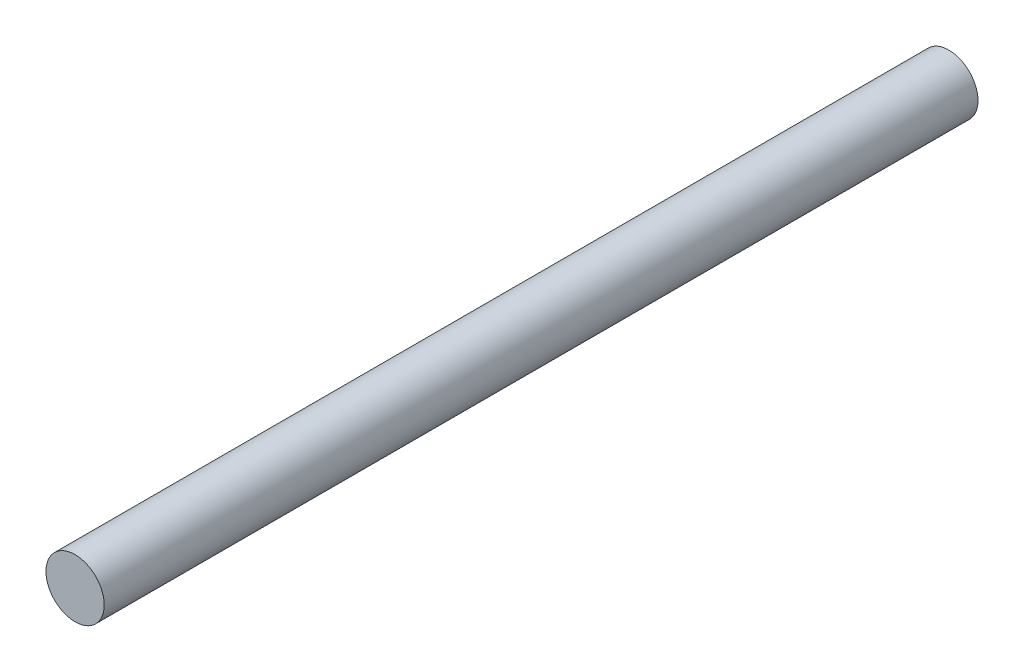
ISO-10303-21;
HEADER;
FILE_DESCRIPTION(('STEP AP214'),'2;1');
FILE_NAME('part.step','',(''),(''),'','','');
FILE_SCHEMA(('AUTOMOTIVE_DESIGN { 1 0 10303 214 1 1 1 1 }'));
ENDSEC;
DATA;
#1=APPLICATION_CONTEXT('core data for automotive mechanical design processes');
#2=APPLICATION_PROTOCOL_DEFINITION('international standard','automotive_design',2000,#1);
#3=PRODUCT_CONTEXT('',#1,'mechanical');
#4=PRODUCT('Part','Part','',(#3));
#5=PRODUCT_RELATED_PRODUCT_CATEGORY('part','',(#4));
#6=PRODUCT_DEFINITION_FORMATION('','',#4);
#7=PRODUCT_DEFINITION_CONTEXT('part definition',#1,'design');
#8=PRODUCT_DEFINITION('design','',#6,#7);
#9=PRODUCT_DEFINITION_SHAPE('','',#8);
#10=(LENGTH_UNIT() NAMED_UNIT(*) SI_UNIT(.MILLI.,.METRE.));
#11=(NAMED_UNIT(*) PLANE_ANGLE_UNIT() SI_UNIT($,.RADIAN.));
#12=(NAMED_UNIT(*) SI_UNIT($,.STERADIAN.) SOLID_ANGLE_UNIT());
#13=UNCERTAINTY_MEASURE_WITH_UNIT(LENGTH_MEASURE(1.E-05),#10,'distance_accuracy_value','');
#14=(GEOMETRIC_REPRESENTATION_CONTEXT(3) GLOBAL_UNCERTAINTY_ASSIGNED_CONTEXT((#13)) GLOBAL_UNIT_ASSIGNED_CONTEXT((#10,
#11,#12)) REPRESENTATION_CONTEXT('',''));
#15=CARTESIAN_POINT('',(0.,0.,0.));
#16=DIRECTION('',(0.,0.,1.));
#17=DIRECTION('',(1.,0.,0.));
#18=AXIS2_PLACEMENT_3D('',#15,#16,#17);
#19=CARTESIAN_POINT('',(0.,0.,75.));
#20=DIRECTION('',(0.,0.,-1.));
#21=DIRECTION('',(-1.,0.,0.));
#22=AXIS2_PLACEMENT_3D('',#19,#20,#21);
#23=CYLINDRICAL_SURFACE('',#22,2.5);
#24=CARTESIAN_POINT('',(0.,0.,75.));
#25=DIRECTION('',(0.,0.,1.));
#26=DIRECTION('',(1.,0.,0.));
#27=AXIS2_PLACEMENT_3D('',#24,#25,#26);
#28=CIRCLE('',#27,2.5);
#29=CARTESIAN_POINT('',(2.5,0.,75.));
#30=VERTEX_POINT('',#29);
#31=EDGE_CURVE('E10',#30,#30,#28,.T.);
#32=ORIENTED_EDGE('',*,*,#31,.F.);
#33=EDGE_LOOP('',(#32));
#34=FACE_BOUND('',#33,.T.);
#35=CARTESIAN_POINT('',(0.,0.,0.));
#36=DIRECTION('',(0.,0.,1.));
#37=DIRECTION('',(1.,0.,0.));
#38=AXIS2_PLACEMENT_3D('',#35,#36,#37);
#39=CIRCLE('',#38,2.5);
#40=CARTESIAN_POINT('',(2.5,0.,0.));
#41=VERTEX_POINT('',#40);
#42=EDGE_CURVE('E34',#41,#41,#39,.T.);
#43=ORIENTED_EDGE('',*,*,#42,.T.);
#44=EDGE_LOOP('',(#43));
#45=FACE_BOUND('',#44,.T.);
#46=ADVANCED_FACE('F31',(#34,#45),#23,.T.);
#47=CARTESIAN_POINT('',(0.,0.,75.));
#48=DIRECTION('',(0.,0.,1.));
#49=DIRECTION('',(1.,0.,0.));
#50=AXIS2_PLACEMENT_3D('',#47,#48,#49);
#51=PLANE('',#50);
#52=ORIENTED_EDGE('',*,*,#31,.T.);
#53=EDGE_LOOP('',(#52));
#54=FACE_BOUND('',#53,.T.);
#55=ADVANCED_FACE('F46',(#54),#51,.T.);
#56=CARTESIAN_POINT('',(0.,0.,0.));
#57=DIRECTION('',(0.,0.,1.));
#58=DIRECTION('',(1.,0.,0.));
#59=AXIS2_PLACEMENT_3D('',#56,#57,#58);
#60=PLANE('',#59);
#61=ORIENTED_EDGE('',*,*,#42,.F.);
#62=EDGE_LOOP('',(#61));
#63=FACE_BOUND('',#62,.T.);
#64=ADVANCED_FACE('F44',(#63),#60,.F.);
#65=CLOSED_SHELL('',(#46,#55,#64));
#66=MANIFOLD_SOLID_BREP('B2',#65);
#67=ADVANCED_BREP_SHAPE_REPRESENTATION('',(#18,#66),#14);
#68=SHAPE_DEFINITION_REPRESENTATION(#9,#67);
ENDSEC;
END-ISO-10303-21;
